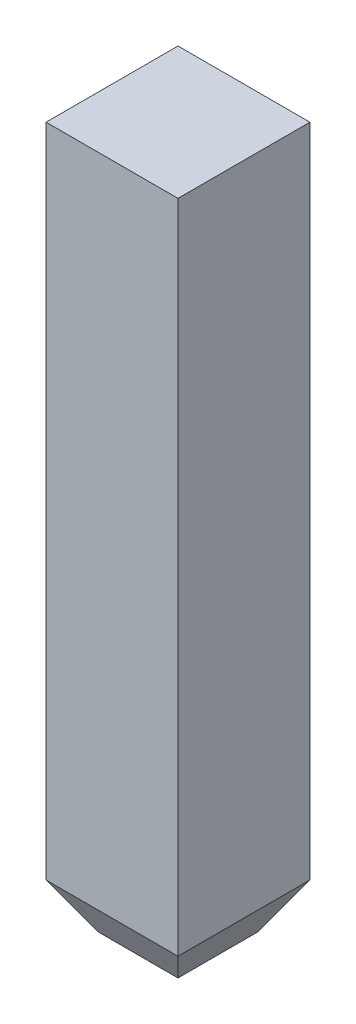
ISO-10303-21;
HEADER;
FILE_DESCRIPTION(('STEP AP214'),'2;1');
FILE_NAME('part.step','',(''),(''),'','','');
FILE_SCHEMA(('AUTOMOTIVE_DESIGN { 1 0 10303 214 1 1 1 1 }'));
ENDSEC;
DATA;
#1=APPLICATION_CONTEXT('core data for automotive mechanical design processes');
#2=APPLICATION_PROTOCOL_DEFINITION('international standard','automotive_design',2000,#1);
#3=PRODUCT_CONTEXT('',#1,'mechanical');
#4=PRODUCT('Part','Part','',(#3));
#5=PRODUCT_RELATED_PRODUCT_CATEGORY('part','',(#4));
#6=PRODUCT_DEFINITION_FORMATION('','',#4);
#7=PRODUCT_DEFINITION_CONTEXT('part definition',#1,'design');
#8=PRODUCT_DEFINITION('design','',#6,#7);
#9=PRODUCT_DEFINITION_SHAPE('','',#8);
#10=(LENGTH_UNIT() NAMED_UNIT(*) SI_UNIT(.MILLI.,.METRE.));
#11=(NAMED_UNIT(*) PLANE_ANGLE_UNIT() SI_UNIT($,.RADIAN.));
#12=(NAMED_UNIT(*) SI_UNIT($,.STERADIAN.) SOLID_ANGLE_UNIT());
#13=UNCERTAINTY_MEASURE_WITH_UNIT(LENGTH_MEASURE(1.E-05),#10,'distance_accuracy_value','');
#14=(GEOMETRIC_REPRESENTATION_CONTEXT(3) GLOBAL_UNCERTAINTY_ASSIGNED_CONTEXT((#13)) GLOBAL_UNIT_ASSIGNED_CONTEXT((#10,
#11,#12)) REPRESENTATION_CONTEXT('',''));
#15=CARTESIAN_POINT('',(0.,0.,0.));
#16=DIRECTION('',(0.,0.,1.));
#17=DIRECTION('',(1.,0.,0.));
#18=AXIS2_PLACEMENT_3D('',#15,#16,#17);
#19=CARTESIAN_POINT('',(1.57,-3.4,0.82));
#20=DIRECTION('',(-1.,0.,0.));
#21=DIRECTION('',(0.,0.,1.));
#22=AXIS2_PLACEMENT_3D('',#19,#20,#21);
#23=PLANE('',#22);
#24=DIRECTION('',(0.,1.,0.));
#25=VECTOR('',#24,1.);
#26=CARTESIAN_POINT('',(1.57,-3.4,0.82));
#27=LINE('',#26,#25);
#28=CARTESIAN_POINT('',(1.57,-3.18349364905389,0.82));
#29=VERTEX_POINT('',#28);
#30=CARTESIAN_POINT('',(1.57,0.,0.82));
#31=VERTEX_POINT('',#30);
#32=EDGE_CURVE('E11',#29,#31,#27,.T.);
#33=ORIENTED_EDGE('',*,*,#32,.F.);
#34=DIRECTION('',(0.,0.,-1.));
#35=VECTOR('',#34,1.);
#36=CARTESIAN_POINT('',(1.57,-3.18349364905389,0.82));
#37=LINE('',#36,#35);
#38=CARTESIAN_POINT('',(1.57,-3.18349364905389,0.18));
#39=VERTEX_POINT('',#38);
#40=EDGE_CURVE('E24',#29,#39,#37,.T.);
#41=ORIENTED_EDGE('',*,*,#40,.T.);
#42=DIRECTION('',(0.,1.,0.));
#43=VECTOR('',#42,1.);
#44=CARTESIAN_POINT('',(1.57,-3.4,0.18));
#45=LINE('',#44,#43);
#46=CARTESIAN_POINT('',(1.57,0.,0.18));
#47=VERTEX_POINT('',#46);
#48=EDGE_CURVE('E117',#39,#47,#45,.T.);
#49=ORIENTED_EDGE('',*,*,#48,.T.);
#50=DIRECTION('',(0.,0.,1.));
#51=VECTOR('',#50,1.);
#52=CARTESIAN_POINT('',(1.57,0.,0.82));
#53=LINE('',#52,#51);
#54=EDGE_CURVE('E115',#47,#31,#53,.T.);
#55=ORIENTED_EDGE('',*,*,#54,.T.);
#56=EDGE_LOOP('',(#33,#41,#49,#55));
#57=FACE_BOUND('',#56,.T.);
#58=ADVANCED_FACE('F17',(#57),#23,.F.);
#59=CARTESIAN_POINT('',(0.93,-3.4,0.82));
#60=DIRECTION('',(0.,0.,-1.));
#61=DIRECTION('',(-1.,0.,0.));
#62=AXIS2_PLACEMENT_3D('',#59,#60,#61);
#63=PLANE('',#62);
#64=DIRECTION('',(0.,1.,0.));
#65=VECTOR('',#64,1.);
#66=CARTESIAN_POINT('',(0.93,-3.4,0.82));
#67=LINE('',#66,#65);
#68=CARTESIAN_POINT('',(0.93,-3.18349364905389,0.82));
#69=VERTEX_POINT('',#68);
#70=CARTESIAN_POINT('',(0.93,0.,0.82));
#71=VERTEX_POINT('',#70);
#72=EDGE_CURVE('E113',#69,#71,#67,.T.);
#73=ORIENTED_EDGE('',*,*,#72,.F.);
#74=DIRECTION('',(1.,0.,0.));
#75=VECTOR('',#74,1.);
#76=CARTESIAN_POINT('',(0.93,-3.18349364905389,0.82));
#77=LINE('',#76,#75);
#78=EDGE_CURVE('E111',#69,#29,#77,.T.);
#79=ORIENTED_EDGE('',*,*,#78,.T.);
#80=ORIENTED_EDGE('',*,*,#32,.T.);
#81=DIRECTION('',(-1.,0.,0.));
#82=VECTOR('',#81,1.);
#83=CARTESIAN_POINT('',(0.93,0.,0.82));
#84=LINE('',#83,#82);
#85=EDGE_CURVE('E109',#31,#71,#84,.T.);
#86=ORIENTED_EDGE('',*,*,#85,.T.);
#87=EDGE_LOOP('',(#73,#79,#80,#86));
#88=FACE_BOUND('',#87,.T.);
#89=ADVANCED_FACE('F139',(#88),#63,.F.);
#90=CARTESIAN_POINT('',(0.93,-3.4,0.18));
#91=DIRECTION('',(1.,0.,0.));
#92=DIRECTION('',(0.,0.,-1.));
#93=AXIS2_PLACEMENT_3D('',#90,#91,#92);
#94=PLANE('',#93);
#95=DIRECTION('',(0.,1.,0.));
#96=VECTOR('',#95,1.);
#97=CARTESIAN_POINT('',(0.93,-3.4,0.18));
#98=LINE('',#97,#96);
#99=CARTESIAN_POINT('',(0.93,-3.18349364905389,0.18));
#100=VERTEX_POINT('',#99);
#101=CARTESIAN_POINT('',(0.93,0.,0.18));
#102=VERTEX_POINT('',#101);
#103=EDGE_CURVE('E107',#100,#102,#98,.T.);
#104=ORIENTED_EDGE('',*,*,#103,.F.);
#105=DIRECTION('',(0.,0.,1.));
#106=VECTOR('',#105,1.);
#107=CARTESIAN_POINT('',(0.93,-3.18349364905389,0.18));
#108=LINE('',#107,#106);
#109=EDGE_CURVE('E104',#100,#69,#108,.T.);
#110=ORIENTED_EDGE('',*,*,#109,.T.);
#111=ORIENTED_EDGE('',*,*,#72,.T.);
#112=DIRECTION('',(0.,0.,-1.));
#113=VECTOR('',#112,1.);
#114=CARTESIAN_POINT('',(0.93,0.,0.18));
#115=LINE('',#114,#113);
#116=EDGE_CURVE('E101',#71,#102,#115,.T.);
#117=ORIENTED_EDGE('',*,*,#116,.T.);
#118=EDGE_LOOP('',(#104,#110,#111,#117));
#119=FACE_BOUND('',#118,.T.);
#120=ADVANCED_FACE('F134',(#119),#94,.F.);
#121=CARTESIAN_POINT('',(1.57,-3.4,0.18));
#122=DIRECTION('',(0.,0.,1.));
#123=DIRECTION('',(1.,0.,0.));
#124=AXIS2_PLACEMENT_3D('',#121,#122,#123);
#125=PLANE('',#124);
#126=ORIENTED_EDGE('',*,*,#48,.F.);
#127=DIRECTION('',(-1.,0.,0.));
#128=VECTOR('',#127,1.);
#129=CARTESIAN_POINT('',(1.57,-3.18349364905389,0.18));
#130=LINE('',#129,#128);
#131=EDGE_CURVE('E98',#39,#100,#130,.T.);
#132=ORIENTED_EDGE('',*,*,#131,.T.);
#133=ORIENTED_EDGE('',*,*,#103,.T.);
#134=DIRECTION('',(1.,0.,0.));
#135=VECTOR('',#134,1.);
#136=CARTESIAN_POINT('',(1.57,0.,0.18));
#137=LINE('',#136,#135);
#138=EDGE_CURVE('E95',#102,#47,#137,.T.);
#139=ORIENTED_EDGE('',*,*,#138,.T.);
#140=EDGE_LOOP('',(#126,#132,#133,#139));
#141=FACE_BOUND('',#140,.T.);
#142=ADVANCED_FACE('F122',(#141),#125,.F.);
#143=CARTESIAN_POINT('',(0.,-3.4,0.));
#144=DIRECTION('',(0.,1.,0.));
#145=DIRECTION('',(0.,0.,1.));
#146=AXIS2_PLACEMENT_3D('',#143,#144,#145);
#147=PLANE('',#146);
#148=DIRECTION('',(0.,0.,-1.));
#149=VECTOR('',#148,1.);
#150=CARTESIAN_POINT('',(1.055,-3.4,0.));
#151=LINE('',#150,#149);
#152=CARTESIAN_POINT('',(1.055,-3.4,0.695));
#153=VERTEX_POINT('',#152);
#154=CARTESIAN_POINT('',(1.055,-3.4,0.305));
#155=VERTEX_POINT('',#154);
#156=EDGE_CURVE('E93',#153,#155,#151,.T.);
#157=ORIENTED_EDGE('',*,*,#156,.T.);
#158=DIRECTION('',(1.,0.,0.));
#159=VECTOR('',#158,1.);
#160=CARTESIAN_POINT('',(0.,-3.4,0.305));
#161=LINE('',#160,#159);
#162=CARTESIAN_POINT('',(1.445,-3.4,0.305));
#163=VERTEX_POINT('',#162);
#164=EDGE_CURVE('E72',#155,#163,#161,.T.);
#165=ORIENTED_EDGE('',*,*,#164,.T.);
#166=DIRECTION('',(0.,0.,1.));
#167=VECTOR('',#166,1.);
#168=CARTESIAN_POINT('',(1.445,-3.4,0.));
#169=LINE('',#168,#167);
#170=CARTESIAN_POINT('',(1.445,-3.4,0.695));
#171=VERTEX_POINT('',#170);
#172=EDGE_CURVE('E66',#163,#171,#169,.T.);
#173=ORIENTED_EDGE('',*,*,#172,.T.);
#174=DIRECTION('',(-1.,0.,0.));
#175=VECTOR('',#174,1.);
#176=CARTESIAN_POINT('',(0.,-3.4,0.695));
#177=LINE('',#176,#175);
#178=EDGE_CURVE('E69',#171,#153,#177,.T.);
#179=ORIENTED_EDGE('',*,*,#178,.T.);
#180=EDGE_LOOP('',(#157,#165,#173,#179));
#181=FACE_BOUND('',#180,.T.);
#182=ADVANCED_FACE('F68',(#181),#147,.F.);
#183=CARTESIAN_POINT('',(0.,0.,0.));
#184=DIRECTION('',(0.,1.,0.));
#185=DIRECTION('',(0.,0.,1.));
#186=AXIS2_PLACEMENT_3D('',#183,#184,#185);
#187=PLANE('',#186);
#188=ORIENTED_EDGE('',*,*,#54,.F.);
#189=ORIENTED_EDGE('',*,*,#138,.F.);
#190=ORIENTED_EDGE('',*,*,#116,.F.);
#191=ORIENTED_EDGE('',*,*,#85,.F.);
#192=EDGE_LOOP('',(#188,#189,#190,#191));
#193=FACE_BOUND('',#192,.T.);
#194=ADVANCED_FACE('F138',(#193),#187,.T.);
#195=CARTESIAN_POINT('',(0.,-3.4,0.695));
#196=DIRECTION('',(0.,0.500000000000001,-0.866025403784438));
#197=DIRECTION('',(-1.,0.,0.));
#198=AXIS2_PLACEMENT_3D('',#195,#196,#197);
#199=PLANE('',#198);
#200=DIRECTION('',(-0.447213595499959,-0.774596669241482,-0.447213595499959));
#201=VECTOR('',#200,1.);
#202=CARTESIAN_POINT('',(1.306,-3.64075506225208,0.555999999999999));
#203=LINE('',#202,#201);
#204=EDGE_CURVE('E82',#29,#171,#203,.T.);
#205=ORIENTED_EDGE('',*,*,#204,.F.);
#206=ORIENTED_EDGE('',*,*,#78,.F.);
#207=DIRECTION('',(-0.447213595499959,0.774596669241483,0.447213595499959));
#208=VECTOR('',#207,1.);
#209=CARTESIAN_POINT('',(0.843999999999999,-3.03453727960297,0.906));
#210=LINE('',#209,#208);
#211=EDGE_CURVE('E84',#153,#69,#210,.T.);
#212=ORIENTED_EDGE('',*,*,#211,.F.);
#213=ORIENTED_EDGE('',*,*,#178,.F.);
#214=EDGE_LOOP('',(#205,#206,#212,#213));
#215=FACE_BOUND('',#214,.T.);
#216=ADVANCED_FACE('F80',(#215),#199,.F.);
#217=CARTESIAN_POINT('',(1.055,-3.4,0.));
#218=DIRECTION('',(0.866025403784438,0.500000000000001,0.));
#219=DIRECTION('',(0.,0.,-1.));
#220=AXIS2_PLACEMENT_3D('',#217,#218,#219);
#221=PLANE('',#220);
#222=ORIENTED_EDGE('',*,*,#211,.T.);
#223=ORIENTED_EDGE('',*,*,#109,.F.);
#224=DIRECTION('',(-0.447213595499959,0.774596669241483,-0.447213595499959));
#225=VECTOR('',#224,1.);
#226=CARTESIAN_POINT('',(0.994,-3.2943449007383,0.244));
#227=LINE('',#226,#225);
#228=EDGE_CURVE('E88',#155,#100,#227,.T.);
#229=ORIENTED_EDGE('',*,*,#228,.F.);
#230=ORIENTED_EDGE('',*,*,#156,.F.);
#231=EDGE_LOOP('',(#222,#223,#229,#230));
#232=FACE_BOUND('',#231,.T.);
#233=ADVANCED_FACE('F132',(#232),#221,.F.);
#234=CARTESIAN_POINT('',(1.445,-3.4,0.));
#235=DIRECTION('',(-0.866025403784438,0.500000000000001,0.));
#236=DIRECTION('',(0.,0.,1.));
#237=AXIS2_PLACEMENT_3D('',#234,#235,#236);
#238=PLANE('',#237);
#239=ORIENTED_EDGE('',*,*,#204,.T.);
#240=ORIENTED_EDGE('',*,*,#172,.F.);
#241=DIRECTION('',(-0.447213595499959,-0.774596669241483,0.447213595499959));
#242=VECTOR('',#241,1.);
#243=CARTESIAN_POINT('',(1.506,-3.2943449007383,0.244));
#244=LINE('',#243,#242);
#245=EDGE_CURVE('E127',#39,#163,#244,.T.);
#246=ORIENTED_EDGE('',*,*,#245,.F.);
#247=ORIENTED_EDGE('',*,*,#40,.F.);
#248=EDGE_LOOP('',(#239,#240,#246,#247));
#249=FACE_BOUND('',#248,.T.);
#250=ADVANCED_FACE('F86',(#249),#238,.F.);
#251=CARTESIAN_POINT('',(0.,-3.4,0.305));
#252=DIRECTION('',(0.,0.500000000000001,0.866025403784438));
#253=DIRECTION('',(1.,0.,0.));
#254=AXIS2_PLACEMENT_3D('',#251,#252,#253);
#255=PLANE('',#254);
#256=ORIENTED_EDGE('',*,*,#228,.T.);
#257=ORIENTED_EDGE('',*,*,#131,.F.);
#258=ORIENTED_EDGE('',*,*,#245,.T.);
#259=ORIENTED_EDGE('',*,*,#164,.F.);
#260=EDGE_LOOP('',(#256,#257,#258,#259));
#261=FACE_BOUND('',#260,.T.);
#262=ADVANCED_FACE('F126',(#261),#255,.F.);
#263=CLOSED_SHELL('',(#58,#89,#120,#142,#182,#194,#216,#233,#250,#262));
#264=MANIFOLD_SOLID_BREP('B1',#263);
#265=ADVANCED_BREP_SHAPE_REPRESENTATION('',(#18,#264),#14);
#266=SHAPE_DEFINITION_REPRESENTATION(#9,#265);
ENDSEC;
END-ISO-10303-21;
